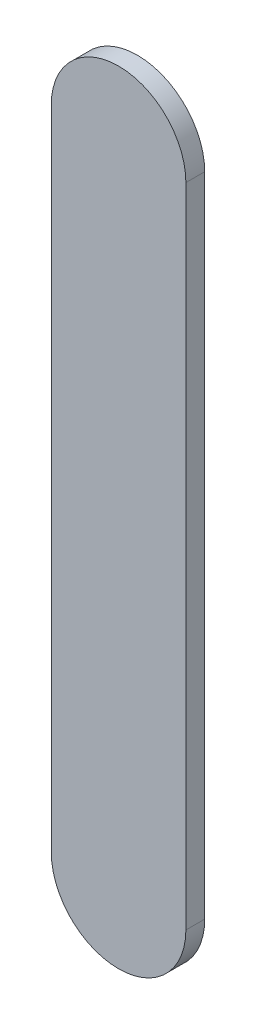
ISO-10303-21;
HEADER;
FILE_DESCRIPTION(('STEP AP214'),'2;1');
FILE_NAME('part.step','',(''),(''),'','','');
FILE_SCHEMA(('AUTOMOTIVE_DESIGN { 1 0 10303 214 1 1 1 1 }'));
ENDSEC;
DATA;
#1=APPLICATION_CONTEXT('core data for automotive mechanical design processes');
#2=APPLICATION_PROTOCOL_DEFINITION('international standard','automotive_design',2000,#1);
#3=PRODUCT_CONTEXT('',#1,'mechanical');
#4=PRODUCT('Part','Part','',(#3));
#5=PRODUCT_RELATED_PRODUCT_CATEGORY('part','',(#4));
#6=PRODUCT_DEFINITION_FORMATION('','',#4);
#7=PRODUCT_DEFINITION_CONTEXT('part definition',#1,'design');
#8=PRODUCT_DEFINITION('design','',#6,#7);
#9=PRODUCT_DEFINITION_SHAPE('','',#8);
#10=(LENGTH_UNIT() NAMED_UNIT(*) SI_UNIT(.MILLI.,.METRE.));
#11=(NAMED_UNIT(*) PLANE_ANGLE_UNIT() SI_UNIT($,.RADIAN.));
#12=(NAMED_UNIT(*) SI_UNIT($,.STERADIAN.) SOLID_ANGLE_UNIT());
#13=UNCERTAINTY_MEASURE_WITH_UNIT(LENGTH_MEASURE(1.E-05),#10,'distance_accuracy_value','');
#14=(GEOMETRIC_REPRESENTATION_CONTEXT(3) GLOBAL_UNCERTAINTY_ASSIGNED_CONTEXT((#13)) GLOBAL_UNIT_ASSIGNED_CONTEXT((#10,
#11,#12)) REPRESENTATION_CONTEXT('',''));
#15=CARTESIAN_POINT('',(0.,0.,0.));
#16=DIRECTION('',(0.,0.,1.));
#17=DIRECTION('',(1.,0.,0.));
#18=AXIS2_PLACEMENT_3D('',#15,#16,#17);
#19=CARTESIAN_POINT('',(95.6339464,88.96546088,0.));
#20=DIRECTION('',(-1.,0.,0.));
#21=DIRECTION('',(0.,1.,0.));
#22=AXIS2_PLACEMENT_3D('',#19,#20,#21);
#23=PLANE('',#22);
#24=DIRECTION('',(0.,1.,0.));
#25=VECTOR('',#24,1.);
#26=CARTESIAN_POINT('',(95.6339464,88.96546088,0.03556));
#27=LINE('',#26,#25);
#28=CARTESIAN_POINT('',(95.6339464,88.96546088,0.03556));
#29=VERTEX_POINT('',#28);
#30=CARTESIAN_POINT('',(95.6339464,90.1869672,0.03556));
#31=VERTEX_POINT('',#30);
#32=EDGE_CURVE('E11',#29,#31,#27,.T.);
#33=ORIENTED_EDGE('',*,*,#32,.F.);
#34=DIRECTION('',(0.,0.,1.));
#35=VECTOR('',#34,1.);
#36=CARTESIAN_POINT('',(95.6339464,88.96546088,0.));
#37=LINE('',#36,#35);
#38=CARTESIAN_POINT('',(95.6339464,88.96546088,0.));
#39=VERTEX_POINT('',#38);
#40=EDGE_CURVE('E24',#39,#29,#37,.T.);
#41=ORIENTED_EDGE('',*,*,#40,.F.);
#42=DIRECTION('',(0.,1.,0.));
#43=VECTOR('',#42,1.);
#44=CARTESIAN_POINT('',(95.6339464,88.96546088,0.));
#45=LINE('',#44,#43);
#46=CARTESIAN_POINT('',(95.6339464,90.1869672,0.));
#47=VERTEX_POINT('',#46);
#48=EDGE_CURVE('E75',#39,#47,#45,.T.);
#49=ORIENTED_EDGE('',*,*,#48,.T.);
#50=DIRECTION('',(0.,0.,1.));
#51=VECTOR('',#50,1.);
#52=CARTESIAN_POINT('',(95.6339464,90.1869672,0.));
#53=LINE('',#52,#51);
#54=EDGE_CURVE('E37',#47,#31,#53,.T.);
#55=ORIENTED_EDGE('',*,*,#54,.T.);
#56=EDGE_LOOP('',(#33,#41,#49,#55));
#57=FACE_BOUND('',#56,.T.);
#58=ADVANCED_FACE('F17',(#57),#23,.F.);
#59=CARTESIAN_POINT('',(95.5069464,90.1869672,0.));
#60=DIRECTION('',(0.,0.,-1.));
#61=DIRECTION('',(1.,-1.11896493820492E-13,0.));
#62=AXIS2_PLACEMENT_3D('',#59,#60,#61);
#63=CYLINDRICAL_SURFACE('',#62,0.126999999999995);
#64=CARTESIAN_POINT('',(95.5069464,90.1869672,0.03556));
#65=DIRECTION('',(0.,0.,1.));
#66=DIRECTION('',(1.,-1.11896493820492E-13,0.));
#67=AXIS2_PLACEMENT_3D('',#64,#65,#66);
#68=CIRCLE('',#67,0.126999999999995);
#69=CARTESIAN_POINT('',(95.3799464,90.1869672,0.03556));
#70=VERTEX_POINT('',#69);
#71=EDGE_CURVE('E83',#31,#70,#68,.T.);
#72=ORIENTED_EDGE('',*,*,#71,.F.);
#73=ORIENTED_EDGE('',*,*,#54,.F.);
#74=CARTESIAN_POINT('',(95.5069464,90.1869672,0.));
#75=DIRECTION('',(0.,0.,1.));
#76=DIRECTION('',(1.,-1.11896493820492E-13,0.));
#77=AXIS2_PLACEMENT_3D('',#74,#75,#76);
#78=CIRCLE('',#77,0.126999999999995);
#79=CARTESIAN_POINT('',(95.3799464,90.1869672,0.));
#80=VERTEX_POINT('',#79);
#81=EDGE_CURVE('E81',#47,#80,#78,.T.);
#82=ORIENTED_EDGE('',*,*,#81,.T.);
#83=DIRECTION('',(0.,0.,1.));
#84=VECTOR('',#83,1.);
#85=CARTESIAN_POINT('',(95.3799464,90.1869672,0.));
#86=LINE('',#85,#84);
#87=EDGE_CURVE('E67',#80,#70,#86,.T.);
#88=ORIENTED_EDGE('',*,*,#87,.T.);
#89=EDGE_LOOP('',(#72,#73,#82,#88));
#90=FACE_BOUND('',#89,.T.);
#91=ADVANCED_FACE('F89',(#90),#63,.T.);
#92=CARTESIAN_POINT('',(95.3799464,90.1869672,0.));
#93=DIRECTION('',(1.,0.,0.));
#94=DIRECTION('',(0.,-1.,0.));
#95=AXIS2_PLACEMENT_3D('',#92,#93,#94);
#96=PLANE('',#95);
#97=DIRECTION('',(0.,-1.,0.));
#98=VECTOR('',#97,1.);
#99=CARTESIAN_POINT('',(95.3799464,90.1869672,0.03556));
#100=LINE('',#99,#98);
#101=CARTESIAN_POINT('',(95.3799464,88.96546088,0.03556));
#102=VERTEX_POINT('',#101);
#103=EDGE_CURVE('E71',#70,#102,#100,.T.);
#104=ORIENTED_EDGE('',*,*,#103,.F.);
#105=ORIENTED_EDGE('',*,*,#87,.F.);
#106=DIRECTION('',(0.,-1.,0.));
#107=VECTOR('',#106,1.);
#108=CARTESIAN_POINT('',(95.3799464,90.1869672,0.));
#109=LINE('',#108,#107);
#110=CARTESIAN_POINT('',(95.3799464,88.96546088,0.));
#111=VERTEX_POINT('',#110);
#112=EDGE_CURVE('E63',#80,#111,#109,.T.);
#113=ORIENTED_EDGE('',*,*,#112,.T.);
#114=DIRECTION('',(0.,0.,1.));
#115=VECTOR('',#114,1.);
#116=CARTESIAN_POINT('',(95.3799464,88.96546088,0.));
#117=LINE('',#116,#115);
#118=EDGE_CURVE('E53',#111,#102,#117,.T.);
#119=ORIENTED_EDGE('',*,*,#118,.T.);
#120=EDGE_LOOP('',(#104,#105,#113,#119));
#121=FACE_BOUND('',#120,.T.);
#122=ADVANCED_FACE('F66',(#121),#96,.F.);
#123=CARTESIAN_POINT('',(95.5069464,88.96546088,0.));
#124=DIRECTION('',(0.,0.,-1.));
#125=DIRECTION('',(-1.,1.11896493820492E-13,0.));
#126=AXIS2_PLACEMENT_3D('',#123,#124,#125);
#127=CYLINDRICAL_SURFACE('',#126,0.126999999999991);
#128=CARTESIAN_POINT('',(95.5069464,88.96546088,0.03556));
#129=DIRECTION('',(0.,0.,1.));
#130=DIRECTION('',(-1.,1.11896493820492E-13,0.));
#131=AXIS2_PLACEMENT_3D('',#128,#129,#130);
#132=CIRCLE('',#131,0.126999999999991);
#133=EDGE_CURVE('E59',#102,#29,#132,.T.);
#134=ORIENTED_EDGE('',*,*,#133,.F.);
#135=ORIENTED_EDGE('',*,*,#118,.F.);
#136=CARTESIAN_POINT('',(95.5069464,88.96546088,0.));
#137=DIRECTION('',(0.,0.,1.));
#138=DIRECTION('',(-1.,1.11896493820492E-13,0.));
#139=AXIS2_PLACEMENT_3D('',#136,#137,#138);
#140=CIRCLE('',#139,0.126999999999991);
#141=EDGE_CURVE('E57',#111,#39,#140,.T.);
#142=ORIENTED_EDGE('',*,*,#141,.T.);
#143=ORIENTED_EDGE('',*,*,#40,.T.);
#144=EDGE_LOOP('',(#134,#135,#142,#143));
#145=FACE_BOUND('',#144,.T.);
#146=ADVANCED_FACE('F55',(#145),#127,.T.);
#147=CARTESIAN_POINT('',(95.6339464,88.96546088,0.));
#148=DIRECTION('',(0.,0.,-1.));
#149=DIRECTION('',(-1.,0.,0.));
#150=AXIS2_PLACEMENT_3D('',#147,#148,#149);
#151=PLANE('',#150);
#152=ORIENTED_EDGE('',*,*,#141,.F.);
#153=ORIENTED_EDGE('',*,*,#112,.F.);
#154=ORIENTED_EDGE('',*,*,#81,.F.);
#155=ORIENTED_EDGE('',*,*,#48,.F.);
#156=EDGE_LOOP('',(#152,#153,#154,#155));
#157=FACE_BOUND('',#156,.T.);
#158=ADVANCED_FACE('F74',(#157),#151,.T.);
#159=CARTESIAN_POINT('',(95.6339464,88.96546088,0.03556));
#160=DIRECTION('',(0.,0.,-1.));
#161=DIRECTION('',(-1.,0.,0.));
#162=AXIS2_PLACEMENT_3D('',#159,#160,#161);
#163=PLANE('',#162);
#164=ORIENTED_EDGE('',*,*,#32,.T.);
#165=ORIENTED_EDGE('',*,*,#71,.T.);
#166=ORIENTED_EDGE('',*,*,#103,.T.);
#167=ORIENTED_EDGE('',*,*,#133,.T.);
#168=EDGE_LOOP('',(#164,#165,#166,#167));
#169=FACE_BOUND('',#168,.T.);
#170=ADVANCED_FACE('F91',(#169),#163,.F.);
#171=CLOSED_SHELL('',(#58,#91,#122,#146,#158,#170));
#172=MANIFOLD_SOLID_BREP('B1',#171);
#173=ADVANCED_BREP_SHAPE_REPRESENTATION('',(#18,#172),#14);
#174=SHAPE_DEFINITION_REPRESENTATION(#9,#173);
ENDSEC;
END-ISO-10303-21;
